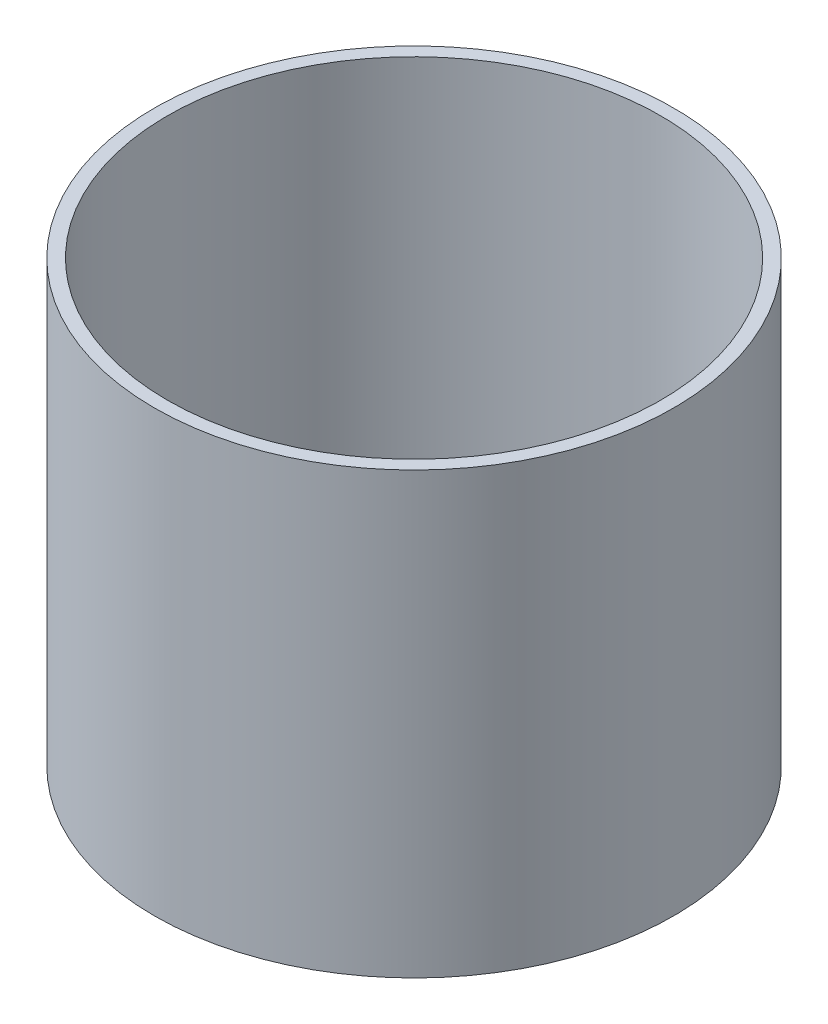
ISO-10303-21;
HEADER;
FILE_DESCRIPTION(('STEP AP214'),'2;1');
FILE_NAME('part.step','',(''),(''),'','','');
FILE_SCHEMA(('AUTOMOTIVE_DESIGN { 1 0 10303 214 1 1 1 1 }'));
ENDSEC;
DATA;
#1=APPLICATION_CONTEXT('core data for automotive mechanical design processes');
#2=APPLICATION_PROTOCOL_DEFINITION('international standard','automotive_design',2000,#1);
#3=PRODUCT_CONTEXT('',#1,'mechanical');
#4=PRODUCT('Part','Part','',(#3));
#5=PRODUCT_RELATED_PRODUCT_CATEGORY('part','',(#4));
#6=PRODUCT_DEFINITION_FORMATION('','',#4);
#7=PRODUCT_DEFINITION_CONTEXT('part definition',#1,'design');
#8=PRODUCT_DEFINITION('design','',#6,#7);
#9=PRODUCT_DEFINITION_SHAPE('','',#8);
#10=(LENGTH_UNIT() NAMED_UNIT(*) SI_UNIT(.MILLI.,.METRE.));
#11=(NAMED_UNIT(*) PLANE_ANGLE_UNIT() SI_UNIT($,.RADIAN.));
#12=(NAMED_UNIT(*) SI_UNIT($,.STERADIAN.) SOLID_ANGLE_UNIT());
#13=UNCERTAINTY_MEASURE_WITH_UNIT(LENGTH_MEASURE(1.E-05),#10,'distance_accuracy_value','');
#14=(GEOMETRIC_REPRESENTATION_CONTEXT(3) GLOBAL_UNCERTAINTY_ASSIGNED_CONTEXT((#13)) GLOBAL_UNIT_ASSIGNED_CONTEXT((#10,
#11,#12)) REPRESENTATION_CONTEXT('',''));
#15=CARTESIAN_POINT('',(0.,0.,0.));
#16=DIRECTION('',(0.,0.,1.));
#17=DIRECTION('',(1.,0.,0.));
#18=AXIS2_PLACEMENT_3D('',#15,#16,#17);
#19=CARTESIAN_POINT('',(0.,79.32166,0.));
#20=DIRECTION('',(0.,1.,0.));
#21=DIRECTION('',(0.,0.,1.));
#22=AXIS2_PLACEMENT_3D('',#19,#20,#21);
#23=PLANE('',#22);
#24=CARTESIAN_POINT('',(0.,79.32166,0.));
#25=DIRECTION('',(0.,1.,0.));
#26=DIRECTION('',(0.,0.,1.));
#27=AXIS2_PLACEMENT_3D('',#24,#25,#26);
#28=CIRCLE('',#27,93.6625);
#29=CARTESIAN_POINT('',(0.,79.32166,93.6625));
#30=VERTEX_POINT('',#29);
#31=EDGE_CURVE('E10',#30,#30,#28,.T.);
#32=ORIENTED_EDGE('',*,*,#31,.T.);
#33=EDGE_LOOP('',(#32));
#34=FACE_BOUND('',#33,.T.);
#35=CARTESIAN_POINT('',(0.,79.32166,0.));
#36=DIRECTION('',(0.,1.,0.));
#37=DIRECTION('',(0.,0.,1.));
#38=AXIS2_PLACEMENT_3D('',#35,#36,#37);
#39=CIRCLE('',#38,88.9);
#40=CARTESIAN_POINT('',(0.,79.32166,88.9));
#41=VERTEX_POINT('',#40);
#42=EDGE_CURVE('E46',#41,#41,#39,.T.);
#43=ORIENTED_EDGE('',*,*,#42,.F.);
#44=EDGE_LOOP('',(#43));
#45=FACE_BOUND('',#44,.T.);
#46=ADVANCED_FACE('F35',(#34,#45),#23,.T.);
#47=CARTESIAN_POINT('',(0.,-79.32166,0.));
#48=DIRECTION('',(0.,1.,0.));
#49=DIRECTION('',(0.,0.,1.));
#50=AXIS2_PLACEMENT_3D('',#47,#48,#49);
#51=PLANE('',#50);
#52=CARTESIAN_POINT('',(0.,-79.32166,0.));
#53=DIRECTION('',(0.,1.,0.));
#54=DIRECTION('',(0.,0.,1.));
#55=AXIS2_PLACEMENT_3D('',#52,#53,#54);
#56=CIRCLE('',#55,93.6625);
#57=CARTESIAN_POINT('',(0.,-79.32166,93.6625));
#58=VERTEX_POINT('',#57);
#59=EDGE_CURVE('E39',#58,#58,#56,.T.);
#60=ORIENTED_EDGE('',*,*,#59,.F.);
#61=EDGE_LOOP('',(#60));
#62=FACE_BOUND('',#61,.T.);
#63=CARTESIAN_POINT('',(0.,-79.32166,0.));
#64=DIRECTION('',(0.,1.,0.));
#65=DIRECTION('',(0.,0.,1.));
#66=AXIS2_PLACEMENT_3D('',#63,#64,#65);
#67=CIRCLE('',#66,88.9);
#68=CARTESIAN_POINT('',(0.,-79.32166,88.9));
#69=VERTEX_POINT('',#68);
#70=EDGE_CURVE('E48',#69,#69,#67,.T.);
#71=ORIENTED_EDGE('',*,*,#70,.T.);
#72=EDGE_LOOP('',(#71));
#73=FACE_BOUND('',#72,.T.);
#74=ADVANCED_FACE('F58',(#62,#73),#51,.F.);
#75=CARTESIAN_POINT('',(0.,79.32166,0.));
#76=DIRECTION('',(0.,-1.,0.));
#77=DIRECTION('',(0.,0.,-1.));
#78=AXIS2_PLACEMENT_3D('',#75,#76,#77);
#79=CYLINDRICAL_SURFACE('',#78,93.6625);
#80=ORIENTED_EDGE('',*,*,#31,.F.);
#81=EDGE_LOOP('',(#80));
#82=FACE_BOUND('',#81,.T.);
#83=ORIENTED_EDGE('',*,*,#59,.T.);
#84=EDGE_LOOP('',(#83));
#85=FACE_BOUND('',#84,.T.);
#86=ADVANCED_FACE('F37',(#82,#85),#79,.T.);
#87=CARTESIAN_POINT('',(0.,79.32166,0.));
#88=DIRECTION('',(0.,-1.,0.));
#89=DIRECTION('',(0.,0.,-1.));
#90=AXIS2_PLACEMENT_3D('',#87,#88,#89);
#91=CYLINDRICAL_SURFACE('',#90,88.9);
#92=ORIENTED_EDGE('',*,*,#42,.T.);
#93=EDGE_LOOP('',(#92));
#94=FACE_BOUND('',#93,.T.);
#95=ORIENTED_EDGE('',*,*,#70,.F.);
#96=EDGE_LOOP('',(#95));
#97=FACE_BOUND('',#96,.T.);
#98=ADVANCED_FACE('F54',(#94,#97),#91,.F.);
#99=CLOSED_SHELL('',(#46,#74,#86,#98));
#100=MANIFOLD_SOLID_BREP('B2',#99);
#101=ADVANCED_BREP_SHAPE_REPRESENTATION('',(#18,#100),#14);
#102=SHAPE_DEFINITION_REPRESENTATION(#9,#101);
ENDSEC;
END-ISO-10303-21;
